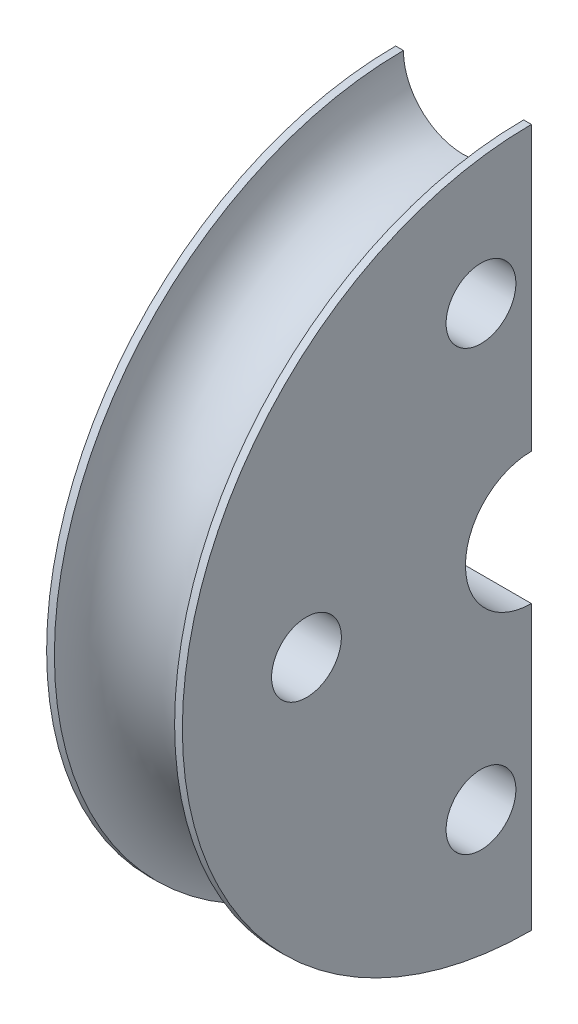
ISO-10303-21;
HEADER;
FILE_DESCRIPTION(('STEP AP214'),'2;1');
FILE_NAME('part.step','',(''),(''),'','','');
FILE_SCHEMA(('AUTOMOTIVE_DESIGN { 1 0 10303 214 1 1 1 1 }'));
ENDSEC;
DATA;
#1=APPLICATION_CONTEXT('core data for automotive mechanical design processes');
#2=APPLICATION_PROTOCOL_DEFINITION('international standard','automotive_design',2000,#1);
#3=PRODUCT_CONTEXT('',#1,'mechanical');
#4=PRODUCT('Part','Part','',(#3));
#5=PRODUCT_RELATED_PRODUCT_CATEGORY('part','',(#4));
#6=PRODUCT_DEFINITION_FORMATION('','',#4);
#7=PRODUCT_DEFINITION_CONTEXT('part definition',#1,'design');
#8=PRODUCT_DEFINITION('design','',#6,#7);
#9=PRODUCT_DEFINITION_SHAPE('','',#8);
#10=(LENGTH_UNIT() NAMED_UNIT(*) SI_UNIT(.MILLI.,.METRE.));
#11=(NAMED_UNIT(*) PLANE_ANGLE_UNIT() SI_UNIT($,.RADIAN.));
#12=(NAMED_UNIT(*) SI_UNIT($,.STERADIAN.) SOLID_ANGLE_UNIT());
#13=UNCERTAINTY_MEASURE_WITH_UNIT(LENGTH_MEASURE(1.E-05),#10,'distance_accuracy_value','');
#14=(GEOMETRIC_REPRESENTATION_CONTEXT(3) GLOBAL_UNCERTAINTY_ASSIGNED_CONTEXT((#13)) GLOBAL_UNIT_ASSIGNED_CONTEXT((#10,
#11,#12)) REPRESENTATION_CONTEXT('',''));
#15=CARTESIAN_POINT('',(0.,0.,0.));
#16=DIRECTION('',(0.,0.,1.));
#17=DIRECTION('',(1.,0.,0.));
#18=AXIS2_PLACEMENT_3D('',#15,#16,#17);
#19=CARTESIAN_POINT('',(0.,0.,0.));
#20=DIRECTION('',(-1.,0.,0.));
#21=DIRECTION('',(0.,0.,1.));
#22=AXIS2_PLACEMENT_3D('',#19,#20,#21);
#23=CYLINDRICAL_SURFACE('',#22,90.);
#24=CARTESIAN_POINT('',(0.,0.,0.));
#25=DIRECTION('',(-1.,0.,0.));
#26=DIRECTION('',(0.,0.,1.));
#27=AXIS2_PLACEMENT_3D('',#24,#25,#26);
#28=CIRCLE('',#27,90.);
#29=CARTESIAN_POINT('',(0.,-90.,-6.28466640991764E-13));
#30=VERTEX_POINT('',#29);
#31=CARTESIAN_POINT('',(0.,90.,0.));
#32=VERTEX_POINT('',#31);
#33=EDGE_CURVE('E13',#30,#32,#28,.T.);
#34=ORIENTED_EDGE('',*,*,#33,.F.);
#35=DIRECTION('',(-1.,0.,0.));
#36=VECTOR('',#35,1.);
#37=CARTESIAN_POINT('',(0.,-90.,-6.28466640991764E-13));
#38=LINE('',#37,#36);
#39=CARTESIAN_POINT('',(2.,-90.,-6.28466640991764E-13));
#40=VERTEX_POINT('',#39);
#41=EDGE_CURVE('E129',#40,#30,#38,.T.);
#42=ORIENTED_EDGE('',*,*,#41,.F.);
#43=CARTESIAN_POINT('',(2.,0.,0.));
#44=DIRECTION('',(-1.,0.,0.));
#45=DIRECTION('',(0.,0.,1.));
#46=AXIS2_PLACEMENT_3D('',#43,#44,#45);
#47=CIRCLE('',#46,90.);
#48=CARTESIAN_POINT('',(2.,90.,0.));
#49=VERTEX_POINT('',#48);
#50=EDGE_CURVE('E61',#40,#49,#47,.T.);
#51=ORIENTED_EDGE('',*,*,#50,.T.);
#52=DIRECTION('',(-1.,0.,0.));
#53=VECTOR('',#52,1.);
#54=CARTESIAN_POINT('',(0.,90.,0.));
#55=LINE('',#54,#53);
#56=EDGE_CURVE('E109',#49,#32,#55,.T.);
#57=ORIENTED_EDGE('',*,*,#56,.T.);
#58=EDGE_LOOP('',(#34,#42,#51,#57));
#59=FACE_BOUND('',#58,.T.);
#60=ADVANCED_FACE('F46',(#59),#23,.T.);
#61=CARTESIAN_POINT('',(0.,-17.,-1.18710365520667E-13));
#62=DIRECTION('',(1.,0.,0.));
#63=DIRECTION('',(0.,0.,-1.));
#64=AXIS2_PLACEMENT_3D('',#61,#62,#63);
#65=PLANE('',#64);
#66=CARTESIAN_POINT('',(0.,0.,58.));
#67=DIRECTION('',(-1.,0.,0.));
#68=DIRECTION('',(0.,0.,1.));
#69=AXIS2_PLACEMENT_3D('',#66,#67,#68);
#70=CIRCLE('',#69,9.00000000000002);
#71=CARTESIAN_POINT('',(0.,0.,67.));
#72=VERTEX_POINT('',#71);
#73=EDGE_CURVE('E206',#72,#72,#70,.T.);
#74=ORIENTED_EDGE('',*,*,#73,.F.);
#75=EDGE_LOOP('',(#74));
#76=FACE_BOUND('',#75,.T.);
#77=CARTESIAN_POINT('',(0.,56.5243310442503,13.));
#78=DIRECTION('',(-1.,0.,0.));
#79=DIRECTION('',(0.,0.,1.));
#80=AXIS2_PLACEMENT_3D('',#77,#78,#79);
#81=CIRCLE('',#80,9.00000000000001);
#82=CARTESIAN_POINT('',(0.,56.5243310442503,22.));
#83=VERTEX_POINT('',#82);
#84=EDGE_CURVE('E212',#83,#83,#81,.T.);
#85=ORIENTED_EDGE('',*,*,#84,.F.);
#86=EDGE_LOOP('',(#85));
#87=FACE_BOUND('',#86,.T.);
#88=CARTESIAN_POINT('',(0.,-56.5243310442505,12.9999999999994));
#89=DIRECTION('',(-1.,0.,0.));
#90=DIRECTION('',(0.,0.,1.));
#91=AXIS2_PLACEMENT_3D('',#88,#89,#90);
#92=CIRCLE('',#91,9.00000000000001);
#93=CARTESIAN_POINT('',(0.,-56.5243310442505,21.9999999999994));
#94=VERTEX_POINT('',#93);
#95=EDGE_CURVE('E209',#94,#94,#92,.T.);
#96=ORIENTED_EDGE('',*,*,#95,.F.);
#97=EDGE_LOOP('',(#96));
#98=FACE_BOUND('',#97,.T.);
#99=CARTESIAN_POINT('',(0.,0.,0.));
#100=DIRECTION('',(-1.,0.,0.));
#101=DIRECTION('',(0.,0.,1.));
#102=AXIS2_PLACEMENT_3D('',#99,#100,#101);
#103=CIRCLE('',#102,17.);
#104=CARTESIAN_POINT('',(0.,-17.,-1.18710365520667E-13));
#105=VERTEX_POINT('',#104);
#106=CARTESIAN_POINT('',(0.,17.,0.));
#107=VERTEX_POINT('',#106);
#108=EDGE_CURVE('E54',#105,#107,#103,.T.);
#109=ORIENTED_EDGE('',*,*,#108,.F.);
#110=DIRECTION('',(0.,1.,0.));
#111=VECTOR('',#110,1.);
#112=CARTESIAN_POINT('',(0.,-17.,-1.18710365520667E-13));
#113=LINE('',#112,#111);
#114=EDGE_CURVE('E105',#30,#105,#113,.T.);
#115=ORIENTED_EDGE('',*,*,#114,.F.);
#116=ORIENTED_EDGE('',*,*,#33,.T.);
#117=DIRECTION('',(0.,-1.,0.));
#118=VECTOR('',#117,1.);
#119=CARTESIAN_POINT('',(0.,17.,0.));
#120=LINE('',#119,#118);
#121=EDGE_CURVE('E102',#32,#107,#120,.T.);
#122=ORIENTED_EDGE('',*,*,#121,.T.);
#123=EDGE_LOOP('',(#109,#115,#116,#122));
#124=FACE_BOUND('',#123,.T.);
#125=ADVANCED_FACE('F48',(#76,#87,#98,#124),#65,.F.);
#126=CARTESIAN_POINT('',(0.,0.,0.));
#127=DIRECTION('',(-1.,0.,0.));
#128=DIRECTION('',(0.,0.,1.));
#129=AXIS2_PLACEMENT_3D('',#126,#127,#128);
#130=CYLINDRICAL_SURFACE('',#129,17.);
#131=CARTESIAN_POINT('',(35.,0.,0.));
#132=DIRECTION('',(-1.,0.,0.));
#133=DIRECTION('',(0.,0.,1.));
#134=AXIS2_PLACEMENT_3D('',#131,#132,#133);
#135=CIRCLE('',#134,17.);
#136=CARTESIAN_POINT('',(35.,-17.,-1.18710365520667E-13));
#137=VERTEX_POINT('',#136);
#138=CARTESIAN_POINT('',(35.,17.,0.));
#139=VERTEX_POINT('',#138);
#140=EDGE_CURVE('E147',#137,#139,#135,.T.);
#141=ORIENTED_EDGE('',*,*,#140,.F.);
#142=DIRECTION('',(1.,0.,0.));
#143=VECTOR('',#142,1.);
#144=CARTESIAN_POINT('',(0.,-17.,-1.18710365520667E-13));
#145=LINE('',#144,#143);
#146=EDGE_CURVE('E132',#105,#137,#145,.T.);
#147=ORIENTED_EDGE('',*,*,#146,.F.);
#148=ORIENTED_EDGE('',*,*,#108,.T.);
#149=DIRECTION('',(1.,0.,0.));
#150=VECTOR('',#149,1.);
#151=CARTESIAN_POINT('',(0.,17.,0.));
#152=LINE('',#151,#150);
#153=EDGE_CURVE('E117',#107,#139,#152,.T.);
#154=ORIENTED_EDGE('',*,*,#153,.T.);
#155=EDGE_LOOP('',(#141,#147,#148,#154));
#156=FACE_BOUND('',#155,.T.);
#157=ADVANCED_FACE('F150',(#156),#130,.F.);
#158=CARTESIAN_POINT('',(35.,-90.,-6.28466640991764E-13));
#159=DIRECTION('',(-1.,0.,0.));
#160=DIRECTION('',(0.,0.,1.));
#161=AXIS2_PLACEMENT_3D('',#158,#159,#160);
#162=PLANE('',#161);
#163=CARTESIAN_POINT('',(35.,0.,58.));
#164=DIRECTION('',(-1.,0.,0.));
#165=DIRECTION('',(0.,0.,1.));
#166=AXIS2_PLACEMENT_3D('',#163,#164,#165);
#167=CIRCLE('',#166,9.00000000000002);
#168=CARTESIAN_POINT('',(35.,0.,67.));
#169=VERTEX_POINT('',#168);
#170=EDGE_CURVE('E203',#169,#169,#167,.T.);
#171=ORIENTED_EDGE('',*,*,#170,.T.);
#172=EDGE_LOOP('',(#171));
#173=FACE_BOUND('',#172,.T.);
#174=CARTESIAN_POINT('',(35.,56.5243310442503,13.));
#175=DIRECTION('',(-1.,0.,0.));
#176=DIRECTION('',(0.,0.,1.));
#177=AXIS2_PLACEMENT_3D('',#174,#175,#176);
#178=CIRCLE('',#177,9.00000000000001);
#179=CARTESIAN_POINT('',(35.,56.5243310442503,22.));
#180=VERTEX_POINT('',#179);
#181=EDGE_CURVE('E207',#180,#180,#178,.T.);
#182=ORIENTED_EDGE('',*,*,#181,.T.);
#183=EDGE_LOOP('',(#182));
#184=FACE_BOUND('',#183,.T.);
#185=CARTESIAN_POINT('',(35.,-56.5243310442505,12.9999999999994));
#186=DIRECTION('',(-1.,0.,0.));
#187=DIRECTION('',(0.,0.,1.));
#188=AXIS2_PLACEMENT_3D('',#185,#186,#187);
#189=CIRCLE('',#188,9.00000000000001);
#190=CARTESIAN_POINT('',(35.,-56.5243310442505,21.9999999999994));
#191=VERTEX_POINT('',#190);
#192=EDGE_CURVE('E112',#191,#191,#189,.T.);
#193=ORIENTED_EDGE('',*,*,#192,.T.);
#194=EDGE_LOOP('',(#193));
#195=FACE_BOUND('',#194,.T.);
#196=CARTESIAN_POINT('',(35.,0.,0.));
#197=DIRECTION('',(-1.,0.,0.));
#198=DIRECTION('',(0.,0.,1.));
#199=AXIS2_PLACEMENT_3D('',#196,#197,#198);
#200=CIRCLE('',#199,90.);
#201=CARTESIAN_POINT('',(35.,-90.,-6.28466640991764E-13));
#202=VERTEX_POINT('',#201);
#203=CARTESIAN_POINT('',(35.,90.,0.));
#204=VERTEX_POINT('',#203);
#205=EDGE_CURVE('E145',#202,#204,#200,.T.);
#206=ORIENTED_EDGE('',*,*,#205,.F.);
#207=DIRECTION('',(0.,-1.,0.));
#208=VECTOR('',#207,1.);
#209=CARTESIAN_POINT('',(35.,-90.,-6.28466640991764E-13));
#210=LINE('',#209,#208);
#211=EDGE_CURVE('E135',#137,#202,#210,.T.);
#212=ORIENTED_EDGE('',*,*,#211,.F.);
#213=ORIENTED_EDGE('',*,*,#140,.T.);
#214=DIRECTION('',(0.,1.,0.));
#215=VECTOR('',#214,1.);
#216=CARTESIAN_POINT('',(35.,90.,0.));
#217=LINE('',#216,#215);
#218=EDGE_CURVE('E119',#139,#204,#217,.T.);
#219=ORIENTED_EDGE('',*,*,#218,.T.);
#220=EDGE_LOOP('',(#206,#212,#213,#219));
#221=FACE_BOUND('',#220,.T.);
#222=ADVANCED_FACE('F158',(#173,#184,#195,#221),#162,.F.);
#223=CARTESIAN_POINT('',(0.,0.,0.));
#224=DIRECTION('',(-1.,0.,0.));
#225=DIRECTION('',(0.,0.,1.));
#226=AXIS2_PLACEMENT_3D('',#223,#224,#225);
#227=CYLINDRICAL_SURFACE('',#226,90.);
#228=CARTESIAN_POINT('',(33.,0.,0.));
#229=DIRECTION('',(-1.,0.,0.));
#230=DIRECTION('',(0.,0.,1.));
#231=AXIS2_PLACEMENT_3D('',#228,#229,#230);
#232=CIRCLE('',#231,90.);
#233=CARTESIAN_POINT('',(33.,-90.,-6.28466640991764E-13));
#234=VERTEX_POINT('',#233);
#235=CARTESIAN_POINT('',(33.,90.,0.));
#236=VERTEX_POINT('',#235);
#237=EDGE_CURVE('E69',#234,#236,#232,.T.);
#238=ORIENTED_EDGE('',*,*,#237,.F.);
#239=DIRECTION('',(-1.,0.,0.));
#240=VECTOR('',#239,1.);
#241=CARTESIAN_POINT('',(35.,-90.,-6.28466640991764E-13));
#242=LINE('',#241,#240);
#243=EDGE_CURVE('E138',#202,#234,#242,.T.);
#244=ORIENTED_EDGE('',*,*,#243,.F.);
#245=ORIENTED_EDGE('',*,*,#205,.T.);
#246=DIRECTION('',(-1.,0.,0.));
#247=VECTOR('',#246,1.);
#248=CARTESIAN_POINT('',(35.,90.,0.));
#249=LINE('',#248,#247);
#250=EDGE_CURVE('E125',#204,#236,#249,.T.);
#251=ORIENTED_EDGE('',*,*,#250,.T.);
#252=EDGE_LOOP('',(#238,#244,#245,#251));
#253=FACE_BOUND('',#252,.T.);
#254=ADVANCED_FACE('F156',(#253),#227,.T.);
#255=CARTESIAN_POINT('',(17.5,0.,0.));
#256=DIRECTION('',(-1.,0.,0.));
#257=DIRECTION('',(0.,0.,1.));
#258=AXIS2_PLACEMENT_3D('',#255,#256,#257);
#259=TOROIDAL_SURFACE('',#258,90.,15.5);
#260=CARTESIAN_POINT('',(17.5,-90.,-6.28466640991764E-13));
#261=DIRECTION('',(0.,0.,1.));
#262=DIRECTION('',(1.,0.,0.));
#263=AXIS2_PLACEMENT_3D('',#260,#261,#262);
#264=CIRCLE('',#263,15.5);
#265=EDGE_CURVE('E140',#234,#40,#264,.T.);
#266=ORIENTED_EDGE('',*,*,#265,.F.);
#267=ORIENTED_EDGE('',*,*,#237,.T.);
#268=CARTESIAN_POINT('',(17.5,90.,0.));
#269=DIRECTION('',(0.,0.,-1.));
#270=DIRECTION('',(1.,0.,0.));
#271=AXIS2_PLACEMENT_3D('',#268,#269,#270);
#272=CIRCLE('',#271,15.5);
#273=EDGE_CURVE('E127',#236,#49,#272,.T.);
#274=ORIENTED_EDGE('',*,*,#273,.T.);
#275=ORIENTED_EDGE('',*,*,#50,.F.);
#276=EDGE_LOOP('',(#266,#267,#274,#275));
#277=FACE_BOUND('',#276,.T.);
#278=ADVANCED_FACE('F154',(#277),#259,.F.);
#279=CARTESIAN_POINT('',(17.5,-90.,-6.28466640991764E-13));
#280=DIRECTION('',(0.,0.,-1.));
#281=DIRECTION('',(1.,0.,0.));
#282=AXIS2_PLACEMENT_3D('',#279,#280,#281);
#283=PLANE('',#282);
#284=ORIENTED_EDGE('',*,*,#41,.T.);
#285=ORIENTED_EDGE('',*,*,#114,.T.);
#286=ORIENTED_EDGE('',*,*,#146,.T.);
#287=ORIENTED_EDGE('',*,*,#211,.T.);
#288=ORIENTED_EDGE('',*,*,#243,.T.);
#289=ORIENTED_EDGE('',*,*,#265,.T.);
#290=EDGE_LOOP('',(#284,#285,#286,#287,#288,#289));
#291=FACE_BOUND('',#290,.T.);
#292=ADVANCED_FACE('F152',(#291),#283,.T.);
#293=CARTESIAN_POINT('',(17.5,90.,0.));
#294=DIRECTION('',(0.,0.,1.));
#295=DIRECTION('',(1.,0.,0.));
#296=AXIS2_PLACEMENT_3D('',#293,#294,#295);
#297=PLANE('',#296);
#298=ORIENTED_EDGE('',*,*,#56,.F.);
#299=ORIENTED_EDGE('',*,*,#273,.F.);
#300=ORIENTED_EDGE('',*,*,#250,.F.);
#301=ORIENTED_EDGE('',*,*,#218,.F.);
#302=ORIENTED_EDGE('',*,*,#153,.F.);
#303=ORIENTED_EDGE('',*,*,#121,.F.);
#304=EDGE_LOOP('',(#298,#299,#300,#301,#302,#303));
#305=FACE_BOUND('',#304,.T.);
#306=ADVANCED_FACE('F114',(#305),#297,.F.);
#307=CARTESIAN_POINT('',(35.,-56.5243310442505,12.9999999999994));
#308=DIRECTION('',(-1.,0.,0.));
#309=DIRECTION('',(0.,0.,1.));
#310=AXIS2_PLACEMENT_3D('',#307,#308,#309);
#311=CYLINDRICAL_SURFACE('',#310,9.00000000000001);
#312=ORIENTED_EDGE('',*,*,#192,.F.);
#313=EDGE_LOOP('',(#312));
#314=FACE_BOUND('',#313,.T.);
#315=ORIENTED_EDGE('',*,*,#95,.T.);
#316=EDGE_LOOP('',(#315));
#317=FACE_BOUND('',#316,.T.);
#318=ADVANCED_FACE('F185',(#314,#317),#311,.F.);
#319=CARTESIAN_POINT('',(35.,56.5243310442503,13.));
#320=DIRECTION('',(-1.,0.,0.));
#321=DIRECTION('',(0.,0.,1.));
#322=AXIS2_PLACEMENT_3D('',#319,#320,#321);
#323=CYLINDRICAL_SURFACE('',#322,9.00000000000001);
#324=ORIENTED_EDGE('',*,*,#181,.F.);
#325=EDGE_LOOP('',(#324));
#326=FACE_BOUND('',#325,.T.);
#327=ORIENTED_EDGE('',*,*,#84,.T.);
#328=EDGE_LOOP('',(#327));
#329=FACE_BOUND('',#328,.T.);
#330=ADVANCED_FACE('F189',(#326,#329),#323,.F.);
#331=CARTESIAN_POINT('',(35.,0.,58.));
#332=DIRECTION('',(-1.,0.,0.));
#333=DIRECTION('',(0.,0.,1.));
#334=AXIS2_PLACEMENT_3D('',#331,#332,#333);
#335=CYLINDRICAL_SURFACE('',#334,9.00000000000002);
#336=ORIENTED_EDGE('',*,*,#170,.F.);
#337=EDGE_LOOP('',(#336));
#338=FACE_BOUND('',#337,.T.);
#339=ORIENTED_EDGE('',*,*,#73,.T.);
#340=EDGE_LOOP('',(#339));
#341=FACE_BOUND('',#340,.T.);
#342=ADVANCED_FACE('F195',(#338,#341),#335,.F.);
#343=CLOSED_SHELL('',(#60,#125,#157,#222,#254,#278,#292,#306,#318,#330,#342));
#344=MANIFOLD_SOLID_BREP('B2',#343);
#345=ADVANCED_BREP_SHAPE_REPRESENTATION('',(#18,#344),#14);
#346=SHAPE_DEFINITION_REPRESENTATION(#9,#345);
ENDSEC;
END-ISO-10303-21;
